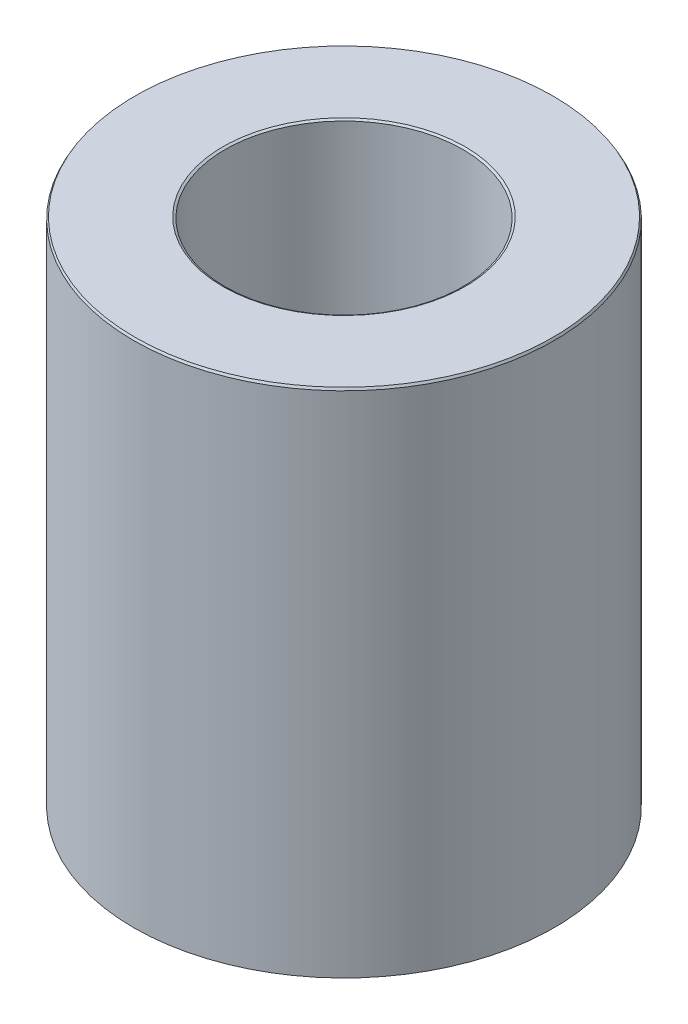
ISO-10303-21;
HEADER;
FILE_DESCRIPTION(('STEP AP214'),'2;1');
FILE_NAME('part.step','',(''),(''),'','','');
FILE_SCHEMA(('AUTOMOTIVE_DESIGN { 1 0 10303 214 1 1 1 1 }'));
ENDSEC;
DATA;
#1=APPLICATION_CONTEXT('core data for automotive mechanical design processes');
#2=APPLICATION_PROTOCOL_DEFINITION('international standard','automotive_design',2000,#1);
#3=PRODUCT_CONTEXT('',#1,'mechanical');
#4=PRODUCT('Part','Part','',(#3));
#5=PRODUCT_RELATED_PRODUCT_CATEGORY('part','',(#4));
#6=PRODUCT_DEFINITION_FORMATION('','',#4);
#7=PRODUCT_DEFINITION_CONTEXT('part definition',#1,'design');
#8=PRODUCT_DEFINITION('design','',#6,#7);
#9=PRODUCT_DEFINITION_SHAPE('','',#8);
#10=(LENGTH_UNIT() NAMED_UNIT(*) SI_UNIT(.MILLI.,.METRE.));
#11=(NAMED_UNIT(*) PLANE_ANGLE_UNIT() SI_UNIT($,.RADIAN.));
#12=(NAMED_UNIT(*) SI_UNIT($,.STERADIAN.) SOLID_ANGLE_UNIT());
#13=UNCERTAINTY_MEASURE_WITH_UNIT(LENGTH_MEASURE(1.E-05),#10,'distance_accuracy_value','');
#14=(GEOMETRIC_REPRESENTATION_CONTEXT(3) GLOBAL_UNCERTAINTY_ASSIGNED_CONTEXT((#13)) GLOBAL_UNIT_ASSIGNED_CONTEXT((#10,
#11,#12)) REPRESENTATION_CONTEXT('',''));
#15=CARTESIAN_POINT('',(0.,0.,0.));
#16=DIRECTION('',(0.,0.,1.));
#17=DIRECTION('',(1.,0.,0.));
#18=AXIS2_PLACEMENT_3D('',#15,#16,#17);
#19=CARTESIAN_POINT('',(0.,121.739695494697,0.));
#20=DIRECTION('',(0.,-1.,0.));
#21=DIRECTION('',(0.,0.,-1.));
#22=AXIS2_PLACEMENT_3D('',#19,#20,#21);
#23=CYLINDRICAL_SURFACE('',#22,50.);
#24=CARTESIAN_POINT('',(0.,0.301977255182787,0.));
#25=DIRECTION('',(0.,1.,0.));
#26=DIRECTION('',(0.,0.,1.));
#27=AXIS2_PLACEMENT_3D('',#24,#25,#26);
#28=CIRCLE('',#27,50.);
#29=CARTESIAN_POINT('',(0.,0.301977255182787,50.));
#30=VERTEX_POINT('',#29);
#31=EDGE_CURVE('E10',#30,#30,#28,.T.);
#32=ORIENTED_EDGE('',*,*,#31,.T.);
#33=EDGE_LOOP('',(#32));
#34=FACE_BOUND('',#33,.T.);
#35=CARTESIAN_POINT('',(0.,121.216655545991,0.));
#36=DIRECTION('',(0.,1.,0.));
#37=DIRECTION('',(0.,0.,1.));
#38=AXIS2_PLACEMENT_3D('',#35,#36,#37);
#39=CIRCLE('',#38,50.);
#40=CARTESIAN_POINT('',(0.,121.216655545991,50.));
#41=VERTEX_POINT('',#40);
#42=EDGE_CURVE('E50',#41,#41,#39,.F.);
#43=ORIENTED_EDGE('',*,*,#42,.T.);
#44=EDGE_LOOP('',(#43));
#45=FACE_BOUND('',#44,.T.);
#46=ADVANCED_FACE('F39',(#34,#45),#23,.T.);
#47=CARTESIAN_POINT('',(0.,121.739695494697,0.));
#48=DIRECTION('',(0.,1.,0.));
#49=DIRECTION('',(0.,0.,1.));
#50=AXIS2_PLACEMENT_3D('',#47,#48,#49);
#51=PLANE('',#50);
#52=CARTESIAN_POINT('',(0.,121.739695494697,0.));
#53=DIRECTION('',(0.,1.,0.));
#54=DIRECTION('',(0.,0.,1.));
#55=AXIS2_PLACEMENT_3D('',#52,#53,#54);
#56=CIRCLE('',#55,28.800120766078);
#57=CARTESIAN_POINT('',(0.,121.739695494697,28.800120766078));
#58=VERTEX_POINT('',#57);
#59=EDGE_CURVE('E58',#58,#58,#56,.F.);
#60=ORIENTED_EDGE('',*,*,#59,.T.);
#61=EDGE_LOOP('',(#60));
#62=FACE_BOUND('',#61,.T.);
#63=CARTESIAN_POINT('',(0.,121.739695494697,0.));
#64=DIRECTION('',(0.,1.,0.));
#65=DIRECTION('',(0.,0.,1.));
#66=AXIS2_PLACEMENT_3D('',#63,#64,#65);
#67=CIRCLE('',#66,49.6980227448171);
#68=CARTESIAN_POINT('',(0.,121.739695494697,49.6980227448171));
#69=VERTEX_POINT('',#68);
#70=EDGE_CURVE('E61',#69,#69,#67,.T.);
#71=ORIENTED_EDGE('',*,*,#70,.T.);
#72=EDGE_LOOP('',(#71));
#73=FACE_BOUND('',#72,.T.);
#74=ADVANCED_FACE('F88',(#62,#73),#51,.T.);
#75=CARTESIAN_POINT('',(0.,0.,0.));
#76=DIRECTION('',(0.,1.,0.));
#77=DIRECTION('',(0.,0.,1.));
#78=AXIS2_PLACEMENT_3D('',#75,#76,#77);
#79=PLANE('',#78);
#80=CARTESIAN_POINT('',(0.,0.,0.));
#81=DIRECTION('',(0.,1.,0.));
#82=DIRECTION('',(0.,0.,1.));
#83=AXIS2_PLACEMENT_3D('',#80,#81,#82);
#84=CIRCLE('',#83,28.579058072554);
#85=CARTESIAN_POINT('',(0.,0.,28.579058072554));
#86=VERTEX_POINT('',#85);
#87=EDGE_CURVE('E51',#86,#86,#84,.T.);
#88=ORIENTED_EDGE('',*,*,#87,.T.);
#89=EDGE_LOOP('',(#88));
#90=FACE_BOUND('',#89,.T.);
#91=CARTESIAN_POINT('',(0.,0.,0.));
#92=DIRECTION('',(0.,1.,0.));
#93=DIRECTION('',(0.,0.,1.));
#94=AXIS2_PLACEMENT_3D('',#91,#92,#93);
#95=CIRCLE('',#94,49.4769600512932);
#96=CARTESIAN_POINT('',(0.,0.,49.4769600512932));
#97=VERTEX_POINT('',#96);
#98=EDGE_CURVE('E54',#97,#97,#95,.F.);
#99=ORIENTED_EDGE('',*,*,#98,.T.);
#100=EDGE_LOOP('',(#99));
#101=FACE_BOUND('',#100,.T.);
#102=ADVANCED_FACE('F83',(#90,#101),#79,.F.);
#103=CARTESIAN_POINT('',(0.,121.739695494697,0.));
#104=DIRECTION('',(0.,-1.,0.));
#105=DIRECTION('',(0.,0.,-1.));
#106=AXIS2_PLACEMENT_3D('',#103,#104,#105);
#107=CYLINDRICAL_SURFACE('',#106,28.2770808173712);
#108=CARTESIAN_POINT('',(0.,121.437718239515,0.));
#109=DIRECTION('',(0.,1.,0.));
#110=DIRECTION('',(0.,0.,1.));
#111=AXIS2_PLACEMENT_3D('',#108,#109,#110);
#112=CIRCLE('',#111,28.2770808173712);
#113=CARTESIAN_POINT('',(0.,121.437718239515,28.2770808173712));
#114=VERTEX_POINT('',#113);
#115=EDGE_CURVE('E67',#114,#114,#112,.T.);
#116=ORIENTED_EDGE('',*,*,#115,.T.);
#117=EDGE_LOOP('',(#116));
#118=FACE_BOUND('',#117,.T.);
#119=CARTESIAN_POINT('',(0.,0.523039948706838,0.));
#120=DIRECTION('',(0.,1.,0.));
#121=DIRECTION('',(0.,0.,1.));
#122=AXIS2_PLACEMENT_3D('',#119,#120,#121);
#123=CIRCLE('',#122,28.2770808173712);
#124=CARTESIAN_POINT('',(0.,0.523039948706838,28.2770808173712));
#125=VERTEX_POINT('',#124);
#126=EDGE_CURVE('E69',#125,#125,#123,.F.);
#127=ORIENTED_EDGE('',*,*,#126,.T.);
#128=EDGE_LOOP('',(#127));
#129=FACE_BOUND('',#128,.T.);
#130=ADVANCED_FACE('F71',(#118,#129),#107,.F.);
#131=CARTESIAN_POINT('',(0.,121.437718239515,0.));
#132=DIRECTION('',(0.,1.,0.));
#133=DIRECTION('',(0.,0.,1.));
#134=AXIS2_PLACEMENT_3D('',#131,#132,#133);
#135=CONICAL_SURFACE('',#134,28.2770808173712,1.04719755119659);
#136=ORIENTED_EDGE('',*,*,#59,.F.);
#137=EDGE_LOOP('',(#136));
#138=FACE_BOUND('',#137,.T.);
#139=ORIENTED_EDGE('',*,*,#115,.F.);
#140=EDGE_LOOP('',(#139));
#141=FACE_BOUND('',#140,.T.);
#142=ADVANCED_FACE('F77',(#138,#141),#135,.F.);
#143=CARTESIAN_POINT('',(0.,0.,0.));
#144=DIRECTION('',(0.,-1.,0.));
#145=DIRECTION('',(0.,0.,-1.));
#146=AXIS2_PLACEMENT_3D('',#143,#144,#145);
#147=CONICAL_SURFACE('',#146,28.579058072554,0.523598775598279);
#148=ORIENTED_EDGE('',*,*,#126,.F.);
#149=EDGE_LOOP('',(#148));
#150=FACE_BOUND('',#149,.T.);
#151=ORIENTED_EDGE('',*,*,#87,.F.);
#152=EDGE_LOOP('',(#151));
#153=FACE_BOUND('',#152,.T.);
#154=ADVANCED_FACE('F73',(#150,#153),#147,.F.);
#155=CARTESIAN_POINT('',(0.,0.301977255182787,0.));
#156=DIRECTION('',(0.,1.,0.));
#157=DIRECTION('',(0.,0.,1.));
#158=AXIS2_PLACEMENT_3D('',#155,#156,#157);
#159=CONICAL_SURFACE('',#158,50.,1.04719755119661);
#160=ORIENTED_EDGE('',*,*,#98,.F.);
#161=EDGE_LOOP('',(#160));
#162=FACE_BOUND('',#161,.T.);
#163=ORIENTED_EDGE('',*,*,#31,.F.);
#164=EDGE_LOOP('',(#163));
#165=FACE_BOUND('',#164,.T.);
#166=ADVANCED_FACE('F76',(#162,#165),#159,.T.);
#167=CARTESIAN_POINT('',(0.,121.739695494697,0.));
#168=DIRECTION('',(0.,-1.,0.));
#169=DIRECTION('',(0.,0.,-1.));
#170=AXIS2_PLACEMENT_3D('',#167,#168,#169);
#171=CONICAL_SURFACE('',#170,49.6980227448171,0.523598775598303);
#172=ORIENTED_EDGE('',*,*,#42,.F.);
#173=EDGE_LOOP('',(#172));
#174=FACE_BOUND('',#173,.T.);
#175=ORIENTED_EDGE('',*,*,#70,.F.);
#176=EDGE_LOOP('',(#175));
#177=FACE_BOUND('',#176,.T.);
#178=ADVANCED_FACE('F45',(#174,#177),#171,.T.);
#179=CLOSED_SHELL('',(#46,#74,#102,#130,#142,#154,#166,#178));
#180=MANIFOLD_SOLID_BREP('B2',#179);
#181=ADVANCED_BREP_SHAPE_REPRESENTATION('',(#18,#180),#14);
#182=SHAPE_DEFINITION_REPRESENTATION(#9,#181);
ENDSEC;
END-ISO-10303-21;
